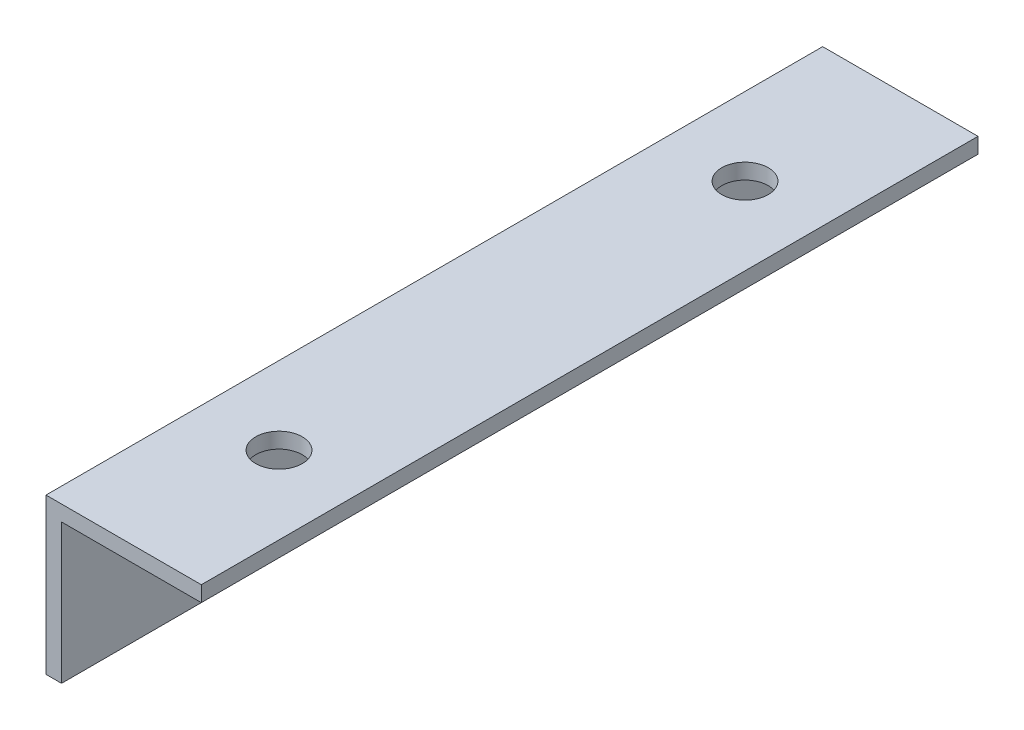
ISO-10303-21;
HEADER;
FILE_DESCRIPTION(('STEP AP214'),'2;1');
FILE_NAME('part.step','',(''),(''),'','','');
FILE_SCHEMA(('AUTOMOTIVE_DESIGN { 1 0 10303 214 1 1 1 1 }'));
ENDSEC;
DATA;
#1=APPLICATION_CONTEXT('core data for automotive mechanical design processes');
#2=APPLICATION_PROTOCOL_DEFINITION('international standard','automotive_design',2000,#1);
#3=PRODUCT_CONTEXT('',#1,'mechanical');
#4=PRODUCT('Part','Part','',(#3));
#5=PRODUCT_RELATED_PRODUCT_CATEGORY('part','',(#4));
#6=PRODUCT_DEFINITION_FORMATION('','',#4);
#7=PRODUCT_DEFINITION_CONTEXT('part definition',#1,'design');
#8=PRODUCT_DEFINITION('design','',#6,#7);
#9=PRODUCT_DEFINITION_SHAPE('','',#8);
#10=(LENGTH_UNIT() NAMED_UNIT(*) SI_UNIT(.MILLI.,.METRE.));
#11=(NAMED_UNIT(*) PLANE_ANGLE_UNIT() SI_UNIT($,.RADIAN.));
#12=(NAMED_UNIT(*) SI_UNIT($,.STERADIAN.) SOLID_ANGLE_UNIT());
#13=UNCERTAINTY_MEASURE_WITH_UNIT(LENGTH_MEASURE(1.E-05),#10,'distance_accuracy_value','');
#14=(GEOMETRIC_REPRESENTATION_CONTEXT(3) GLOBAL_UNCERTAINTY_ASSIGNED_CONTEXT((#13)) GLOBAL_UNIT_ASSIGNED_CONTEXT((#10,
#11,#12)) REPRESENTATION_CONTEXT('',''));
#15=CARTESIAN_POINT('',(0.,0.,0.));
#16=DIRECTION('',(0.,0.,1.));
#17=DIRECTION('',(1.,0.,0.));
#18=AXIS2_PLACEMENT_3D('',#15,#16,#17);
#19=CARTESIAN_POINT('',(0.,0.,100.));
#20=DIRECTION('',(0.,1.,0.));
#21=DIRECTION('',(0.,0.,1.));
#22=AXIS2_PLACEMENT_3D('',#19,#20,#21);
#23=PLANE('',#22);
#24=DIRECTION('',(1.,0.,0.));
#25=VECTOR('',#24,1.);
#26=CARTESIAN_POINT('',(0.,0.,0.));
#27=LINE('',#26,#25);
#28=CARTESIAN_POINT('',(0.,0.,0.));
#29=VERTEX_POINT('',#28);
#30=CARTESIAN_POINT('',(2.,0.,0.));
#31=VERTEX_POINT('',#30);
#32=EDGE_CURVE('E116',#29,#31,#27,.T.);
#33=ORIENTED_EDGE('',*,*,#32,.T.);
#34=DIRECTION('',(0.,0.,-1.));
#35=VECTOR('',#34,1.);
#36=CARTESIAN_POINT('',(2.,0.,100.));
#37=LINE('',#36,#35);
#38=CARTESIAN_POINT('',(2.,0.,100.));
#39=VERTEX_POINT('',#38);
#40=EDGE_CURVE('E11',#39,#31,#37,.T.);
#41=ORIENTED_EDGE('',*,*,#40,.F.);
#42=DIRECTION('',(1.,0.,0.));
#43=VECTOR('',#42,1.);
#44=CARTESIAN_POINT('',(0.,0.,100.));
#45=LINE('',#44,#43);
#46=CARTESIAN_POINT('',(0.,0.,100.));
#47=VERTEX_POINT('',#46);
#48=EDGE_CURVE('E127',#47,#39,#45,.T.);
#49=ORIENTED_EDGE('',*,*,#48,.F.);
#50=DIRECTION('',(0.,0.,-1.));
#51=VECTOR('',#50,1.);
#52=CARTESIAN_POINT('',(0.,0.,100.));
#53=LINE('',#52,#51);
#54=EDGE_CURVE('E112',#47,#29,#53,.T.);
#55=ORIENTED_EDGE('',*,*,#54,.T.);
#56=EDGE_LOOP('',(#33,#41,#49,#55));
#57=FACE_BOUND('',#56,.T.);
#58=ADVANCED_FACE('F32',(#57),#23,.F.);
#59=CARTESIAN_POINT('',(2.,18.,100.));
#60=DIRECTION('',(-1.,0.,0.));
#61=DIRECTION('',(0.,0.,1.));
#62=AXIS2_PLACEMENT_3D('',#59,#60,#61);
#63=PLANE('',#62);
#64=CARTESIAN_POINT('',(2.,10.,20.));
#65=DIRECTION('',(-1.,0.,0.));
#66=DIRECTION('',(0.,0.,1.));
#67=AXIS2_PLACEMENT_3D('',#64,#65,#66);
#68=CIRCLE('',#67,3.);
#69=CARTESIAN_POINT('',(2.,10.,23.));
#70=VERTEX_POINT('',#69);
#71=EDGE_CURVE('E259',#70,#70,#68,.T.);
#72=ORIENTED_EDGE('',*,*,#71,.T.);
#73=EDGE_LOOP('',(#72));
#74=FACE_BOUND('',#73,.T.);
#75=CARTESIAN_POINT('',(2.,10.,80.));
#76=DIRECTION('',(-1.,0.,0.));
#77=DIRECTION('',(0.,0.,1.));
#78=AXIS2_PLACEMENT_3D('',#75,#76,#77);
#79=CIRCLE('',#78,3.00000000000001);
#80=CARTESIAN_POINT('',(2.,10.,83.));
#81=VERTEX_POINT('',#80);
#82=EDGE_CURVE('E120',#81,#81,#79,.T.);
#83=ORIENTED_EDGE('',*,*,#82,.T.);
#84=EDGE_LOOP('',(#83));
#85=FACE_BOUND('',#84,.T.);
#86=DIRECTION('',(0.,1.,0.));
#87=VECTOR('',#86,1.);
#88=CARTESIAN_POINT('',(2.,18.,0.));
#89=LINE('',#88,#87);
#90=CARTESIAN_POINT('',(2.,18.,0.));
#91=VERTEX_POINT('',#90);
#92=EDGE_CURVE('E119',#31,#91,#89,.T.);
#93=ORIENTED_EDGE('',*,*,#92,.T.);
#94=DIRECTION('',(0.,0.,-1.));
#95=VECTOR('',#94,1.);
#96=CARTESIAN_POINT('',(2.,18.,100.));
#97=LINE('',#96,#95);
#98=CARTESIAN_POINT('',(2.,18.,100.));
#99=VERTEX_POINT('',#98);
#100=EDGE_CURVE('E40',#99,#91,#97,.T.);
#101=ORIENTED_EDGE('',*,*,#100,.F.);
#102=DIRECTION('',(0.,1.,0.));
#103=VECTOR('',#102,1.);
#104=CARTESIAN_POINT('',(2.,18.,100.));
#105=LINE('',#104,#103);
#106=EDGE_CURVE('E85',#39,#99,#105,.T.);
#107=ORIENTED_EDGE('',*,*,#106,.F.);
#108=ORIENTED_EDGE('',*,*,#40,.T.);
#109=EDGE_LOOP('',(#93,#101,#107,#108));
#110=FACE_BOUND('',#109,.T.);
#111=ADVANCED_FACE('F155',(#74,#85,#110),#63,.F.);
#112=CARTESIAN_POINT('',(20.,18.,100.));
#113=DIRECTION('',(0.,1.,0.));
#114=DIRECTION('',(0.,0.,1.));
#115=AXIS2_PLACEMENT_3D('',#112,#113,#114);
#116=PLANE('',#115);
#117=CARTESIAN_POINT('',(10.,18.,20.));
#118=DIRECTION('',(0.,1.,0.));
#119=DIRECTION('',(0.,0.,1.));
#120=AXIS2_PLACEMENT_3D('',#117,#118,#119);
#121=CIRCLE('',#120,3.);
#122=CARTESIAN_POINT('',(10.,18.,23.));
#123=VERTEX_POINT('',#122);
#124=EDGE_CURVE('E274',#123,#123,#121,.T.);
#125=ORIENTED_EDGE('',*,*,#124,.T.);
#126=EDGE_LOOP('',(#125));
#127=FACE_BOUND('',#126,.T.);
#128=CARTESIAN_POINT('',(10.,18.,80.));
#129=DIRECTION('',(0.,1.,0.));
#130=DIRECTION('',(0.,0.,1.));
#131=AXIS2_PLACEMENT_3D('',#128,#129,#130);
#132=CIRCLE('',#131,3.);
#133=CARTESIAN_POINT('',(10.,18.,83.));
#134=VERTEX_POINT('',#133);
#135=EDGE_CURVE('E268',#134,#134,#132,.T.);
#136=ORIENTED_EDGE('',*,*,#135,.T.);
#137=EDGE_LOOP('',(#136));
#138=FACE_BOUND('',#137,.T.);
#139=DIRECTION('',(1.,0.,0.));
#140=VECTOR('',#139,1.);
#141=CARTESIAN_POINT('',(20.,18.,0.));
#142=LINE('',#141,#140);
#143=CARTESIAN_POINT('',(20.,18.,0.));
#144=VERTEX_POINT('',#143);
#145=EDGE_CURVE('E122',#91,#144,#142,.T.);
#146=ORIENTED_EDGE('',*,*,#145,.T.);
#147=DIRECTION('',(0.,0.,-1.));
#148=VECTOR('',#147,1.);
#149=CARTESIAN_POINT('',(20.,18.,100.));
#150=LINE('',#149,#148);
#151=CARTESIAN_POINT('',(20.,18.,100.));
#152=VERTEX_POINT('',#151);
#153=EDGE_CURVE('E107',#152,#144,#150,.T.);
#154=ORIENTED_EDGE('',*,*,#153,.F.);
#155=DIRECTION('',(1.,0.,0.));
#156=VECTOR('',#155,1.);
#157=CARTESIAN_POINT('',(20.,18.,100.));
#158=LINE('',#157,#156);
#159=EDGE_CURVE('E98',#99,#152,#158,.T.);
#160=ORIENTED_EDGE('',*,*,#159,.F.);
#161=ORIENTED_EDGE('',*,*,#100,.T.);
#162=EDGE_LOOP('',(#146,#154,#160,#161));
#163=FACE_BOUND('',#162,.T.);
#164=ADVANCED_FACE('F133',(#127,#138,#163),#116,.F.);
#165=CARTESIAN_POINT('',(20.,20.,100.));
#166=DIRECTION('',(-1.,0.,0.));
#167=DIRECTION('',(0.,0.,1.));
#168=AXIS2_PLACEMENT_3D('',#165,#166,#167);
#169=PLANE('',#168);
#170=DIRECTION('',(0.,1.,0.));
#171=VECTOR('',#170,1.);
#172=CARTESIAN_POINT('',(20.,20.,0.));
#173=LINE('',#172,#171);
#174=CARTESIAN_POINT('',(20.,20.,0.));
#175=VERTEX_POINT('',#174);
#176=EDGE_CURVE('E106',#144,#175,#173,.T.);
#177=ORIENTED_EDGE('',*,*,#176,.T.);
#178=DIRECTION('',(0.,0.,-1.));
#179=VECTOR('',#178,1.);
#180=CARTESIAN_POINT('',(20.,20.,100.));
#181=LINE('',#180,#179);
#182=CARTESIAN_POINT('',(20.,20.,100.));
#183=VERTEX_POINT('',#182);
#184=EDGE_CURVE('E103',#183,#175,#181,.T.);
#185=ORIENTED_EDGE('',*,*,#184,.F.);
#186=DIRECTION('',(0.,1.,0.));
#187=VECTOR('',#186,1.);
#188=CARTESIAN_POINT('',(20.,20.,100.));
#189=LINE('',#188,#187);
#190=EDGE_CURVE('E92',#152,#183,#189,.T.);
#191=ORIENTED_EDGE('',*,*,#190,.F.);
#192=ORIENTED_EDGE('',*,*,#153,.T.);
#193=EDGE_LOOP('',(#177,#185,#191,#192));
#194=FACE_BOUND('',#193,.T.);
#195=ADVANCED_FACE('F104',(#194),#169,.F.);
#196=CARTESIAN_POINT('',(0.,20.,100.));
#197=DIRECTION('',(0.,-1.,0.));
#198=DIRECTION('',(0.,0.,-1.));
#199=AXIS2_PLACEMENT_3D('',#196,#197,#198);
#200=PLANE('',#199);
#201=CARTESIAN_POINT('',(10.,20.,20.));
#202=DIRECTION('',(0.,1.,0.));
#203=DIRECTION('',(0.,0.,1.));
#204=AXIS2_PLACEMENT_3D('',#201,#202,#203);
#205=CIRCLE('',#204,3.);
#206=CARTESIAN_POINT('',(10.,20.,23.));
#207=VERTEX_POINT('',#206);
#208=EDGE_CURVE('E277',#207,#207,#205,.T.);
#209=ORIENTED_EDGE('',*,*,#208,.F.);
#210=EDGE_LOOP('',(#209));
#211=FACE_BOUND('',#210,.T.);
#212=CARTESIAN_POINT('',(10.,20.,80.));
#213=DIRECTION('',(0.,1.,0.));
#214=DIRECTION('',(0.,0.,1.));
#215=AXIS2_PLACEMENT_3D('',#212,#213,#214);
#216=CIRCLE('',#215,3.);
#217=CARTESIAN_POINT('',(10.,20.,83.));
#218=VERTEX_POINT('',#217);
#219=EDGE_CURVE('E271',#218,#218,#216,.T.);
#220=ORIENTED_EDGE('',*,*,#219,.F.);
#221=EDGE_LOOP('',(#220));
#222=FACE_BOUND('',#221,.T.);
#223=DIRECTION('',(-1.,0.,0.));
#224=VECTOR('',#223,1.);
#225=CARTESIAN_POINT('',(0.,20.,0.));
#226=LINE('',#225,#224);
#227=CARTESIAN_POINT('',(0.,20.,0.));
#228=VERTEX_POINT('',#227);
#229=EDGE_CURVE('E71',#175,#228,#226,.T.);
#230=ORIENTED_EDGE('',*,*,#229,.T.);
#231=DIRECTION('',(0.,0.,-1.));
#232=VECTOR('',#231,1.);
#233=CARTESIAN_POINT('',(0.,20.,100.));
#234=LINE('',#233,#232);
#235=CARTESIAN_POINT('',(0.,20.,100.));
#236=VERTEX_POINT('',#235);
#237=EDGE_CURVE('E108',#236,#228,#234,.T.);
#238=ORIENTED_EDGE('',*,*,#237,.F.);
#239=DIRECTION('',(-1.,0.,0.));
#240=VECTOR('',#239,1.);
#241=CARTESIAN_POINT('',(0.,20.,100.));
#242=LINE('',#241,#240);
#243=EDGE_CURVE('E96',#183,#236,#242,.T.);
#244=ORIENTED_EDGE('',*,*,#243,.F.);
#245=ORIENTED_EDGE('',*,*,#184,.T.);
#246=EDGE_LOOP('',(#230,#238,#244,#245));
#247=FACE_BOUND('',#246,.T.);
#248=ADVANCED_FACE('F110',(#211,#222,#247),#200,.F.);
#249=CARTESIAN_POINT('',(0.,0.,100.));
#250=DIRECTION('',(1.,0.,0.));
#251=DIRECTION('',(0.,0.,-1.));
#252=AXIS2_PLACEMENT_3D('',#249,#250,#251);
#253=PLANE('',#252);
#254=CARTESIAN_POINT('',(0.,10.,20.));
#255=DIRECTION('',(-1.,0.,0.));
#256=DIRECTION('',(0.,0.,1.));
#257=AXIS2_PLACEMENT_3D('',#254,#255,#256);
#258=CIRCLE('',#257,3.);
#259=CARTESIAN_POINT('',(0.,10.,23.));
#260=VERTEX_POINT('',#259);
#261=EDGE_CURVE('E265',#260,#260,#258,.T.);
#262=ORIENTED_EDGE('',*,*,#261,.F.);
#263=EDGE_LOOP('',(#262));
#264=FACE_BOUND('',#263,.T.);
#265=CARTESIAN_POINT('',(0.,10.,80.));
#266=DIRECTION('',(-1.,0.,0.));
#267=DIRECTION('',(0.,0.,1.));
#268=AXIS2_PLACEMENT_3D('',#265,#266,#267);
#269=CIRCLE('',#268,3.00000000000001);
#270=CARTESIAN_POINT('',(0.,10.,83.));
#271=VERTEX_POINT('',#270);
#272=EDGE_CURVE('E255',#271,#271,#269,.T.);
#273=ORIENTED_EDGE('',*,*,#272,.F.);
#274=EDGE_LOOP('',(#273));
#275=FACE_BOUND('',#274,.T.);
#276=DIRECTION('',(0.,-1.,0.));
#277=VECTOR('',#276,1.);
#278=CARTESIAN_POINT('',(0.,0.,0.));
#279=LINE('',#278,#277);
#280=EDGE_CURVE('E77',#228,#29,#279,.T.);
#281=ORIENTED_EDGE('',*,*,#280,.T.);
#282=ORIENTED_EDGE('',*,*,#54,.F.);
#283=DIRECTION('',(0.,-1.,0.));
#284=VECTOR('',#283,1.);
#285=CARTESIAN_POINT('',(0.,0.,100.));
#286=LINE('',#285,#284);
#287=EDGE_CURVE('E48',#236,#47,#286,.T.);
#288=ORIENTED_EDGE('',*,*,#287,.F.);
#289=ORIENTED_EDGE('',*,*,#237,.T.);
#290=EDGE_LOOP('',(#281,#282,#288,#289));
#291=FACE_BOUND('',#290,.T.);
#292=ADVANCED_FACE('F140',(#264,#275,#291),#253,.F.);
#293=CARTESIAN_POINT('',(0.,0.,100.));
#294=DIRECTION('',(0.,0.,-1.));
#295=DIRECTION('',(-1.,0.,0.));
#296=AXIS2_PLACEMENT_3D('',#293,#294,#295);
#297=PLANE('',#296);
#298=ORIENTED_EDGE('',*,*,#48,.T.);
#299=ORIENTED_EDGE('',*,*,#106,.T.);
#300=ORIENTED_EDGE('',*,*,#159,.T.);
#301=ORIENTED_EDGE('',*,*,#190,.T.);
#302=ORIENTED_EDGE('',*,*,#243,.T.);
#303=ORIENTED_EDGE('',*,*,#287,.T.);
#304=EDGE_LOOP('',(#298,#299,#300,#301,#302,#303));
#305=FACE_BOUND('',#304,.T.);
#306=ADVANCED_FACE('F94',(#305),#297,.F.);
#307=CARTESIAN_POINT('',(0.,0.,0.));
#308=DIRECTION('',(0.,0.,-1.));
#309=DIRECTION('',(-1.,0.,0.));
#310=AXIS2_PLACEMENT_3D('',#307,#308,#309);
#311=PLANE('',#310);
#312=ORIENTED_EDGE('',*,*,#32,.F.);
#313=ORIENTED_EDGE('',*,*,#280,.F.);
#314=ORIENTED_EDGE('',*,*,#229,.F.);
#315=ORIENTED_EDGE('',*,*,#176,.F.);
#316=ORIENTED_EDGE('',*,*,#145,.F.);
#317=ORIENTED_EDGE('',*,*,#92,.F.);
#318=EDGE_LOOP('',(#312,#313,#314,#315,#316,#317));
#319=FACE_BOUND('',#318,.T.);
#320=ADVANCED_FACE('F136',(#319),#311,.T.);
#321=CARTESIAN_POINT('',(20.,10.,80.));
#322=DIRECTION('',(-1.,0.,0.));
#323=DIRECTION('',(0.,0.,1.));
#324=AXIS2_PLACEMENT_3D('',#321,#322,#323);
#325=CYLINDRICAL_SURFACE('',#324,3.00000000000001);
#326=ORIENTED_EDGE('',*,*,#272,.T.);
#327=EDGE_LOOP('',(#326));
#328=FACE_BOUND('',#327,.T.);
#329=ORIENTED_EDGE('',*,*,#82,.F.);
#330=EDGE_LOOP('',(#329));
#331=FACE_BOUND('',#330,.T.);
#332=ADVANCED_FACE('F208',(#328,#331),#325,.F.);
#333=CARTESIAN_POINT('',(20.,10.,20.));
#334=DIRECTION('',(-1.,0.,0.));
#335=DIRECTION('',(0.,0.,1.));
#336=AXIS2_PLACEMENT_3D('',#333,#334,#335);
#337=CYLINDRICAL_SURFACE('',#336,3.);
#338=ORIENTED_EDGE('',*,*,#261,.T.);
#339=EDGE_LOOP('',(#338));
#340=FACE_BOUND('',#339,.T.);
#341=ORIENTED_EDGE('',*,*,#71,.F.);
#342=EDGE_LOOP('',(#341));
#343=FACE_BOUND('',#342,.T.);
#344=ADVANCED_FACE('F201',(#340,#343),#337,.F.);
#345=CARTESIAN_POINT('',(10.,0.,80.));
#346=DIRECTION('',(0.,1.,0.));
#347=DIRECTION('',(0.,0.,1.));
#348=AXIS2_PLACEMENT_3D('',#345,#346,#347);
#349=CYLINDRICAL_SURFACE('',#348,3.);
#350=ORIENTED_EDGE('',*,*,#219,.T.);
#351=EDGE_LOOP('',(#350));
#352=FACE_BOUND('',#351,.T.);
#353=ORIENTED_EDGE('',*,*,#135,.F.);
#354=EDGE_LOOP('',(#353));
#355=FACE_BOUND('',#354,.T.);
#356=ADVANCED_FACE('F191',(#352,#355),#349,.F.);
#357=CARTESIAN_POINT('',(10.,0.,20.));
#358=DIRECTION('',(0.,1.,0.));
#359=DIRECTION('',(0.,0.,1.));
#360=AXIS2_PLACEMENT_3D('',#357,#358,#359);
#361=CYLINDRICAL_SURFACE('',#360,3.);
#362=ORIENTED_EDGE('',*,*,#208,.T.);
#363=EDGE_LOOP('',(#362));
#364=FACE_BOUND('',#363,.T.);
#365=ORIENTED_EDGE('',*,*,#124,.F.);
#366=EDGE_LOOP('',(#365));
#367=FACE_BOUND('',#366,.T.);
#368=ADVANCED_FACE('F187',(#364,#367),#361,.F.);
#369=CLOSED_SHELL('',(#58,#111,#164,#195,#248,#292,#306,#320,#332,#344,#356,#368));
#370=MANIFOLD_SOLID_BREP('B2',#369);
#371=ADVANCED_BREP_SHAPE_REPRESENTATION('',(#18,#370),#14);
#372=SHAPE_DEFINITION_REPRESENTATION(#9,#371);
ENDSEC;
END-ISO-10303-21;
